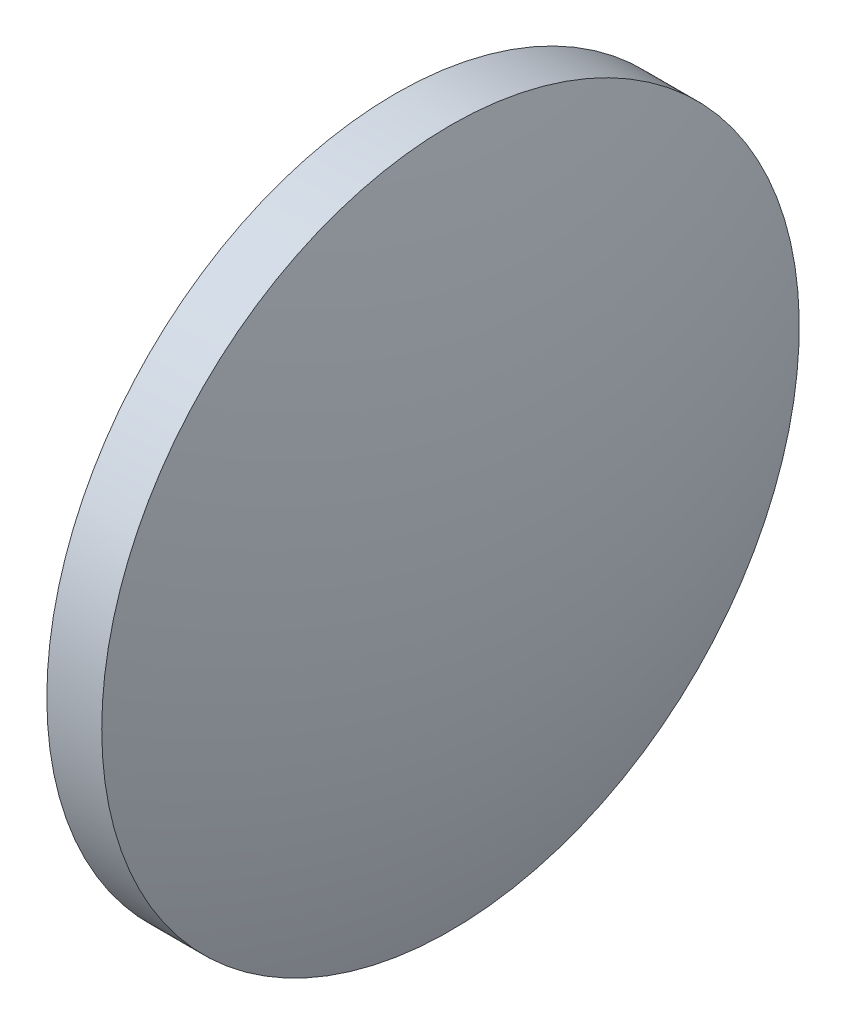
ISO-10303-21;
HEADER;
FILE_DESCRIPTION(('STEP AP214'),'2;1');
FILE_NAME('part.step','',(''),(''),'','','');
FILE_SCHEMA(('AUTOMOTIVE_DESIGN { 1 0 10303 214 1 1 1 1 }'));
ENDSEC;
DATA;
#1=APPLICATION_CONTEXT('core data for automotive mechanical design processes');
#2=APPLICATION_PROTOCOL_DEFINITION('international standard','automotive_design',2000,#1);
#3=PRODUCT_CONTEXT('',#1,'mechanical');
#4=PRODUCT('Part','Part','',(#3));
#5=PRODUCT_RELATED_PRODUCT_CATEGORY('part','',(#4));
#6=PRODUCT_DEFINITION_FORMATION('','',#4);
#7=PRODUCT_DEFINITION_CONTEXT('part definition',#1,'design');
#8=PRODUCT_DEFINITION('design','',#6,#7);
#9=PRODUCT_DEFINITION_SHAPE('','',#8);
#10=(LENGTH_UNIT() NAMED_UNIT(*) SI_UNIT(.MILLI.,.METRE.));
#11=(NAMED_UNIT(*) PLANE_ANGLE_UNIT() SI_UNIT($,.RADIAN.));
#12=(NAMED_UNIT(*) SI_UNIT($,.STERADIAN.) SOLID_ANGLE_UNIT());
#13=UNCERTAINTY_MEASURE_WITH_UNIT(LENGTH_MEASURE(1.E-05),#10,'distance_accuracy_value','');
#14=(GEOMETRIC_REPRESENTATION_CONTEXT(3) GLOBAL_UNCERTAINTY_ASSIGNED_CONTEXT((#13)) GLOBAL_UNIT_ASSIGNED_CONTEXT((#10,
#11,#12)) REPRESENTATION_CONTEXT('',''));
#15=CARTESIAN_POINT('',(0.,0.,0.));
#16=DIRECTION('',(0.,0.,1.));
#17=DIRECTION('',(1.,0.,0.));
#18=AXIS2_PLACEMENT_3D('',#15,#16,#17);
#19=CARTESIAN_POINT('',(125.832968421827,48.6161130231847,0.));
#20=DIRECTION('',(-1.,0.,0.));
#21=DIRECTION('',(0.,1.,0.));
#22=AXIS2_PLACEMENT_3D('',#19,#20,#21);
#23=SPHERICAL_SURFACE('',#22,42.3247669328787);
#24=CARTESIAN_POINT('',(85.4585223460911,48.6161130231848,0.));
#25=DIRECTION('',(-1.,0.,0.));
#26=DIRECTION('',(0.,0.,1.));
#27=AXIS2_PLACEMENT_3D('',#24,#25,#26);
#28=CIRCLE('',#27,12.7);
#29=CARTESIAN_POINT('',(85.4585223460911,48.6161130231848,12.7));
#30=VERTEX_POINT('',#29);
#31=EDGE_CURVE('E46',#30,#30,#28,.T.);
#32=ORIENTED_EDGE('',*,*,#31,.T.);
#33=EDGE_LOOP('',(#32));
#34=FACE_BOUND('',#33,.T.);
#35=ADVANCED_FACE('F39',(#34),#23,.T.);
#36=CARTESIAN_POINT('',(47.0834191274984,48.6161130231848,0.));
#37=DIRECTION('',(-1.,0.,0.));
#38=DIRECTION('',(0.,1.,0.));
#39=AXIS2_PLACEMENT_3D('',#36,#37,#38);
#40=SPHERICAL_SURFACE('',#39,42.3247669328784);
#41=CARTESIAN_POINT('',(87.457865203234,48.6161130231848,0.));
#42=DIRECTION('',(-1.,0.,0.));
#43=DIRECTION('',(0.,0.,1.));
#44=AXIS2_PLACEMENT_3D('',#41,#42,#43);
#45=CIRCLE('',#44,12.7);
#46=CARTESIAN_POINT('',(87.457865203234,48.6161130231848,12.7));
#47=VERTEX_POINT('',#46);
#48=EDGE_CURVE('E10',#47,#47,#45,.T.);
#49=ORIENTED_EDGE('',*,*,#48,.F.);
#50=EDGE_LOOP('',(#49));
#51=FACE_BOUND('',#50,.T.);
#52=ADVANCED_FACE('F56',(#51),#40,.T.);
#53=CARTESIAN_POINT('',(79.3054013508372,48.6161130231848,0.));
#54=DIRECTION('',(-1.,0.,0.));
#55=DIRECTION('',(0.,0.,1.));
#56=AXIS2_PLACEMENT_3D('',#53,#54,#55);
#57=CYLINDRICAL_SURFACE('',#56,12.7);
#58=ORIENTED_EDGE('',*,*,#48,.T.);
#59=EDGE_LOOP('',(#58));
#60=FACE_BOUND('',#59,.T.);
#61=ORIENTED_EDGE('',*,*,#31,.F.);
#62=EDGE_LOOP('',(#61));
#63=FACE_BOUND('',#62,.T.);
#64=ADVANCED_FACE('F54',(#60,#63),#57,.T.);
#65=CLOSED_SHELL('',(#35,#52,#64));
#66=MANIFOLD_SOLID_BREP('B2',#65);
#67=ADVANCED_BREP_SHAPE_REPRESENTATION('',(#18,#66),#14);
#68=SHAPE_DEFINITION_REPRESENTATION(#9,#67);
ENDSEC;
END-ISO-10303-21;
